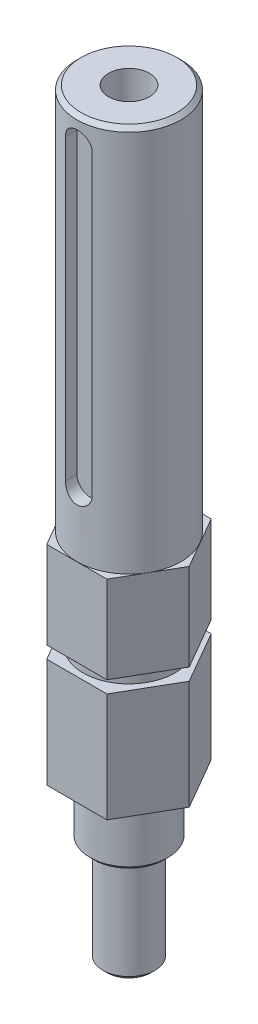
ISO-10303-21;
HEADER;
FILE_DESCRIPTION(('STEP AP214'),'2;1');
FILE_NAME('part.step','',(''),(''),'','','');
FILE_SCHEMA(('AUTOMOTIVE_DESIGN { 1 0 10303 214 1 1 1 1 }'));
ENDSEC;
DATA;
#1=APPLICATION_CONTEXT('core data for automotive mechanical design processes');
#2=APPLICATION_PROTOCOL_DEFINITION('international standard','automotive_design',2000,#1);
#3=PRODUCT_CONTEXT('',#1,'mechanical');
#4=PRODUCT('Part','Part','',(#3));
#5=PRODUCT_RELATED_PRODUCT_CATEGORY('part','',(#4));
#6=PRODUCT_DEFINITION_FORMATION('','',#4);
#7=PRODUCT_DEFINITION_CONTEXT('part definition',#1,'design');
#8=PRODUCT_DEFINITION('design','',#6,#7);
#9=PRODUCT_DEFINITION_SHAPE('','',#8);
#10=(LENGTH_UNIT() NAMED_UNIT(*) SI_UNIT(.MILLI.,.METRE.));
#11=(NAMED_UNIT(*) PLANE_ANGLE_UNIT() SI_UNIT($,.RADIAN.));
#12=(NAMED_UNIT(*) SI_UNIT($,.STERADIAN.) SOLID_ANGLE_UNIT());
#13=UNCERTAINTY_MEASURE_WITH_UNIT(LENGTH_MEASURE(1.E-05),#10,'distance_accuracy_value','');
#14=(GEOMETRIC_REPRESENTATION_CONTEXT(3) GLOBAL_UNCERTAINTY_ASSIGNED_CONTEXT((#13)) GLOBAL_UNIT_ASSIGNED_CONTEXT((#10,
#11,#12)) REPRESENTATION_CONTEXT('',''));
#15=CARTESIAN_POINT('',(0.,0.,0.));
#16=DIRECTION('',(0.,0.,1.));
#17=DIRECTION('',(1.,0.,0.));
#18=AXIS2_PLACEMENT_3D('',#15,#16,#17);
#19=CARTESIAN_POINT('',(-38.3071337161431,-45.212,-16.669011646302));
#20=DIRECTION('',(0.,1.,0.));
#21=DIRECTION('',(0.,0.,1.));
#22=AXIS2_PLACEMENT_3D('',#19,#20,#21);
#23=PLANE('',#22);
#24=CARTESIAN_POINT('',(-38.3071337161431,-45.2119999999923,-16.669011646302));
#25=DIRECTION('',(0.,1.,0.));
#26=DIRECTION('',(0.,0.,1.));
#27=AXIS2_PLACEMENT_3D('',#24,#25,#26);
#28=CIRCLE('',#27,2.65430000009029);
#29=CARTESIAN_POINT('',(-38.3071337161431,-45.2119999999923,-14.0147116462117));
#30=VERTEX_POINT('',#29);
#31=EDGE_CURVE('E19',#30,#30,#28,.T.);
#32=ORIENTED_EDGE('',*,*,#31,.F.);
#33=EDGE_LOOP('',(#32));
#34=FACE_BOUND('',#33,.T.);
#35=ADVANCED_FACE('F16',(#34),#23,.F.);
#36=CARTESIAN_POINT('',(-38.3071337161431,-44.704000000138,-16.669011646302));
#37=DIRECTION('',(0.,1.,0.));
#38=DIRECTION('',(0.,0.,1.));
#39=AXIS2_PLACEMENT_3D('',#36,#37,#38);
#40=CONICAL_SURFACE('',#39,3.16229999994458,0.785398163397448);
#41=CARTESIAN_POINT('',(-38.3071337161431,-44.704,-16.669011646302));
#42=DIRECTION('',(0.,-1.,0.));
#43=DIRECTION('',(0.,0.,-1.));
#44=AXIS2_PLACEMENT_3D('',#41,#42,#43);
#45=CIRCLE('',#44,3.1623);
#46=CARTESIAN_POINT('',(-38.3071337161431,-44.704,-19.831311646302));
#47=VERTEX_POINT('',#46);
#48=EDGE_CURVE('E158',#47,#47,#45,.F.);
#49=ORIENTED_EDGE('',*,*,#48,.F.);
#50=EDGE_LOOP('',(#49));
#51=FACE_BOUND('',#50,.T.);
#52=ORIENTED_EDGE('',*,*,#31,.T.);
#53=EDGE_LOOP('',(#52));
#54=FACE_BOUND('',#53,.T.);
#55=ADVANCED_FACE('F348',(#51,#54),#40,.T.);
#56=CARTESIAN_POINT('',(-38.3071337161431,-45.212,-16.669011646302));
#57=DIRECTION('',(0.,-1.,0.));
#58=DIRECTION('',(0.,0.,-1.));
#59=AXIS2_PLACEMENT_3D('',#56,#57,#58);
#60=CYLINDRICAL_SURFACE('',#59,3.1623);
#61=CARTESIAN_POINT('',(-38.3071337161431,-32.512,-16.669011646302));
#62=DIRECTION('',(0.,-1.,0.));
#63=DIRECTION('',(0.,0.,-1.));
#64=AXIS2_PLACEMENT_3D('',#61,#62,#63);
#65=CIRCLE('',#64,3.1623);
#66=CARTESIAN_POINT('',(-38.3071337161431,-32.512,-19.831311646302));
#67=VERTEX_POINT('',#66);
#68=EDGE_CURVE('E161',#67,#67,#65,.T.);
#69=ORIENTED_EDGE('',*,*,#68,.T.);
#70=EDGE_LOOP('',(#69));
#71=FACE_BOUND('',#70,.T.);
#72=ORIENTED_EDGE('',*,*,#48,.T.);
#73=EDGE_LOOP('',(#72));
#74=FACE_BOUND('',#73,.T.);
#75=ADVANCED_FACE('F333',(#71,#74),#60,.T.);
#76=CARTESIAN_POINT('',(-38.3071337161431,-32.512,-16.669011646302));
#77=DIRECTION('',(0.,1.,0.));
#78=DIRECTION('',(0.,0.,1.));
#79=AXIS2_PLACEMENT_3D('',#76,#77,#78);
#80=PLANE('',#79);
#81=CARTESIAN_POINT('',(-38.3071337161431,-32.511999999997,-16.669011646302));
#82=DIRECTION('',(0.,1.,0.));
#83=DIRECTION('',(0.,0.,1.));
#84=AXIS2_PLACEMENT_3D('',#81,#82,#83);
#85=CIRCLE('',#84,4.24179999994759);
#86=CARTESIAN_POINT('',(-38.3071337161431,-32.511999999997,-12.4272116463544));
#87=VERTEX_POINT('',#86);
#88=EDGE_CURVE('E155',#87,#87,#85,.T.);
#89=ORIENTED_EDGE('',*,*,#88,.F.);
#90=EDGE_LOOP('',(#89));
#91=FACE_BOUND('',#90,.T.);
#92=ORIENTED_EDGE('',*,*,#68,.F.);
#93=EDGE_LOOP('',(#92));
#94=FACE_BOUND('',#93,.T.);
#95=ADVANCED_FACE('F336',(#91,#94),#80,.F.);
#96=CARTESIAN_POINT('',(-38.3071337161431,-32.0039999999722,-16.669011646302));
#97=DIRECTION('',(0.,1.,0.));
#98=DIRECTION('',(0.,0.,1.));
#99=AXIS2_PLACEMENT_3D('',#96,#97,#98);
#100=CONICAL_SURFACE('',#99,4.74980000002926,0.785398163453397);
#101=CARTESIAN_POINT('',(-38.3071337161431,-32.004,-16.669011646302));
#102=DIRECTION('',(0.,-1.,0.));
#103=DIRECTION('',(0.,0.,-1.));
#104=AXIS2_PLACEMENT_3D('',#101,#102,#103);
#105=CIRCLE('',#104,4.7498);
#106=CARTESIAN_POINT('',(-38.3071337161431,-32.004,-21.418811646302));
#107=VERTEX_POINT('',#106);
#108=EDGE_CURVE('E152',#107,#107,#105,.F.);
#109=ORIENTED_EDGE('',*,*,#108,.F.);
#110=EDGE_LOOP('',(#109));
#111=FACE_BOUND('',#110,.T.);
#112=ORIENTED_EDGE('',*,*,#88,.T.);
#113=EDGE_LOOP('',(#112));
#114=FACE_BOUND('',#113,.T.);
#115=ADVANCED_FACE('F338',(#111,#114),#100,.T.);
#116=CARTESIAN_POINT('',(-38.3071337161431,-32.512,-16.669011646302));
#117=DIRECTION('',(0.,-1.,0.));
#118=DIRECTION('',(0.,0.,-1.));
#119=AXIS2_PLACEMENT_3D('',#116,#117,#118);
#120=CYLINDRICAL_SURFACE('',#119,4.7498);
#121=CARTESIAN_POINT('',(-38.3071337161431,-25.4,-16.669011646302));
#122=DIRECTION('',(0.,-1.,0.));
#123=DIRECTION('',(0.,0.,-1.));
#124=AXIS2_PLACEMENT_3D('',#121,#122,#123);
#125=CIRCLE('',#124,4.7498);
#126=CARTESIAN_POINT('',(-38.3071337161431,-25.4,-21.418811646302));
#127=VERTEX_POINT('',#126);
#128=EDGE_CURVE('E134',#127,#127,#125,.T.);
#129=ORIENTED_EDGE('',*,*,#128,.T.);
#130=EDGE_LOOP('',(#129));
#131=FACE_BOUND('',#130,.T.);
#132=ORIENTED_EDGE('',*,*,#108,.T.);
#133=EDGE_LOOP('',(#132));
#134=FACE_BOUND('',#133,.T.);
#135=ADVANCED_FACE('F345',(#131,#134),#120,.T.);
#136=CARTESIAN_POINT('',(-38.3071337161431,-25.4,-3.96901164630201));
#137=DIRECTION('',(0.,1.,0.));
#138=DIRECTION('',(0.,0.,1.));
#139=AXIS2_PLACEMENT_3D('',#136,#137,#138);
#140=PLANE('',#139);
#141=DIRECTION('',(-0.5,0.,0.866025403784438));
#142=VECTOR('',#141,1.);
#143=CARTESIAN_POINT('',(-41.9733079254973,-25.4,-23.019011646302));
#144=LINE('',#143,#142);
#145=CARTESIAN_POINT('',(-41.9733079254973,-25.4,-23.019011646302));
#146=VERTEX_POINT('',#145);
#147=CARTESIAN_POINT('',(-45.6394821348514,-25.4,-16.669011646302));
#148=VERTEX_POINT('',#147);
#149=EDGE_CURVE('E123',#146,#148,#144,.T.);
#150=ORIENTED_EDGE('',*,*,#149,.F.);
#151=DIRECTION('',(-1.,0.,0.));
#152=VECTOR('',#151,1.);
#153=CARTESIAN_POINT('',(-34.640959506789,-25.4,-23.019011646302));
#154=LINE('',#153,#152);
#155=CARTESIAN_POINT('',(-34.640959506789,-25.4,-23.019011646302));
#156=VERTEX_POINT('',#155);
#157=EDGE_CURVE('E128',#156,#146,#154,.T.);
#158=ORIENTED_EDGE('',*,*,#157,.F.);
#159=DIRECTION('',(-0.5,0.,-0.866025403784438));
#160=VECTOR('',#159,1.);
#161=CARTESIAN_POINT('',(-30.9747852974349,-25.4,-16.669011646302));
#162=LINE('',#161,#160);
#163=CARTESIAN_POINT('',(-30.9747852974349,-25.4,-16.669011646302));
#164=VERTEX_POINT('',#163);
#165=EDGE_CURVE('E143',#164,#156,#162,.T.);
#166=ORIENTED_EDGE('',*,*,#165,.F.);
#167=DIRECTION('',(0.500000000000001,0.,-0.866025403784438));
#168=VECTOR('',#167,1.);
#169=CARTESIAN_POINT('',(-34.640959506789,-25.4,-10.319011646302));
#170=LINE('',#169,#168);
#171=CARTESIAN_POINT('',(-34.640959506789,-25.4,-10.319011646302));
#172=VERTEX_POINT('',#171);
#173=EDGE_CURVE('E296',#172,#164,#170,.T.);
#174=ORIENTED_EDGE('',*,*,#173,.F.);
#175=DIRECTION('',(1.,0.,0.));
#176=VECTOR('',#175,1.);
#177=CARTESIAN_POINT('',(-41.9733079254973,-25.4,-10.319011646302));
#178=LINE('',#177,#176);
#179=CARTESIAN_POINT('',(-41.9733079254973,-25.4,-10.319011646302));
#180=VERTEX_POINT('',#179);
#181=EDGE_CURVE('E290',#180,#172,#178,.T.);
#182=ORIENTED_EDGE('',*,*,#181,.F.);
#183=DIRECTION('',(0.5,0.,0.866025403784438));
#184=VECTOR('',#183,1.);
#185=CARTESIAN_POINT('',(-45.6394821348514,-25.4,-16.669011646302));
#186=LINE('',#185,#184);
#187=EDGE_CURVE('E131',#148,#180,#186,.T.);
#188=ORIENTED_EDGE('',*,*,#187,.F.);
#189=EDGE_LOOP('',(#150,#158,#166,#174,#182,#188));
#190=FACE_BOUND('',#189,.T.);
#191=ORIENTED_EDGE('',*,*,#128,.F.);
#192=EDGE_LOOP('',(#191));
#193=FACE_BOUND('',#192,.T.);
#194=ADVANCED_FACE('F125',(#190,#193),#140,.F.);
#195=CARTESIAN_POINT('',(-41.9733079254973,-25.4,-23.019011646302));
#196=DIRECTION('',(-0.866025403784438,0.,-0.5));
#197=DIRECTION('',(-0.5,0.,0.866025403784438));
#198=AXIS2_PLACEMENT_3D('',#195,#196,#197);
#199=PLANE('',#198);
#200=ORIENTED_EDGE('',*,*,#149,.T.);
#201=DIRECTION('',(0.,1.,0.));
#202=VECTOR('',#201,1.);
#203=CARTESIAN_POINT('',(-45.6394821348514,-25.4,-16.669011646302));
#204=LINE('',#203,#202);
#205=CARTESIAN_POINT('',(-45.6394821348514,-12.1158,-16.669011646302));
#206=VERTEX_POINT('',#205);
#207=EDGE_CURVE('E285',#206,#148,#204,.F.);
#208=ORIENTED_EDGE('',*,*,#207,.F.);
#209=DIRECTION('',(0.499999999999997,0.,-0.86602540378444));
#210=VECTOR('',#209,1.);
#211=CARTESIAN_POINT('',(-45.6394821348514,-12.1158,-16.669011646302));
#212=LINE('',#211,#210);
#213=CARTESIAN_POINT('',(-41.9733079254973,-12.1158,-23.019011646302));
#214=VERTEX_POINT('',#213);
#215=EDGE_CURVE('E140',#206,#214,#212,.T.);
#216=ORIENTED_EDGE('',*,*,#215,.T.);
#217=DIRECTION('',(0.,1.,0.));
#218=VECTOR('',#217,1.);
#219=CARTESIAN_POINT('',(-41.9733079254973,-25.4,-23.019011646302));
#220=LINE('',#219,#218);
#221=EDGE_CURVE('E137',#146,#214,#220,.T.);
#222=ORIENTED_EDGE('',*,*,#221,.F.);
#223=EDGE_LOOP('',(#200,#208,#216,#222));
#224=FACE_BOUND('',#223,.T.);
#225=ADVANCED_FACE('F138',(#224),#199,.T.);
#226=CARTESIAN_POINT('',(-34.640959506789,-25.4,-23.019011646302));
#227=DIRECTION('',(0.,0.,-1.));
#228=DIRECTION('',(-1.,0.,0.));
#229=AXIS2_PLACEMENT_3D('',#226,#227,#228);
#230=PLANE('',#229);
#231=ORIENTED_EDGE('',*,*,#157,.T.);
#232=ORIENTED_EDGE('',*,*,#221,.T.);
#233=DIRECTION('',(1.,0.,0.));
#234=VECTOR('',#233,1.);
#235=CARTESIAN_POINT('',(-21.7881364409388,-12.1158,-23.019011646302));
#236=LINE('',#235,#234);
#237=CARTESIAN_POINT('',(-34.640959506789,-12.1158,-23.019011646302));
#238=VERTEX_POINT('',#237);
#239=EDGE_CURVE('E278',#214,#238,#236,.T.);
#240=ORIENTED_EDGE('',*,*,#239,.T.);
#241=DIRECTION('',(0.,1.,0.));
#242=VECTOR('',#241,1.);
#243=CARTESIAN_POINT('',(-34.640959506789,-25.4,-23.019011646302));
#244=LINE('',#243,#242);
#245=EDGE_CURVE('E147',#156,#238,#244,.T.);
#246=ORIENTED_EDGE('',*,*,#245,.F.);
#247=EDGE_LOOP('',(#231,#232,#240,#246));
#248=FACE_BOUND('',#247,.T.);
#249=ADVANCED_FACE('F145',(#248),#230,.T.);
#250=CARTESIAN_POINT('',(-30.9747852974349,-25.4,-16.669011646302));
#251=DIRECTION('',(0.866025403784438,0.,-0.5));
#252=DIRECTION('',(-0.5,0.,-0.866025403784438));
#253=AXIS2_PLACEMENT_3D('',#250,#251,#252);
#254=PLANE('',#253);
#255=ORIENTED_EDGE('',*,*,#165,.T.);
#256=ORIENTED_EDGE('',*,*,#245,.T.);
#257=DIRECTION('',(0.499999999999998,0.,0.86602540378444));
#258=VECTOR('',#257,1.);
#259=CARTESIAN_POINT('',(-34.640959506789,-12.1158,-23.019011646302));
#260=LINE('',#259,#258);
#261=CARTESIAN_POINT('',(-30.9747852974349,-12.1158,-16.669011646302));
#262=VERTEX_POINT('',#261);
#263=EDGE_CURVE('E276',#238,#262,#260,.T.);
#264=ORIENTED_EDGE('',*,*,#263,.T.);
#265=DIRECTION('',(0.,1.,0.));
#266=VECTOR('',#265,1.);
#267=CARTESIAN_POINT('',(-30.9747852974349,-25.4,-16.669011646302));
#268=LINE('',#267,#266);
#269=EDGE_CURVE('E293',#164,#262,#268,.T.);
#270=ORIENTED_EDGE('',*,*,#269,.F.);
#271=EDGE_LOOP('',(#255,#256,#264,#270));
#272=FACE_BOUND('',#271,.T.);
#273=ADVANCED_FACE('F301',(#272),#254,.T.);
#274=CARTESIAN_POINT('',(-34.640959506789,-25.4,-10.319011646302));
#275=DIRECTION('',(0.866025403784438,0.,0.500000000000001));
#276=DIRECTION('',(0.500000000000001,0.,-0.866025403784438));
#277=AXIS2_PLACEMENT_3D('',#274,#275,#276);
#278=PLANE('',#277);
#279=ORIENTED_EDGE('',*,*,#173,.T.);
#280=ORIENTED_EDGE('',*,*,#269,.T.);
#281=DIRECTION('',(-0.499999999999998,0.,0.86602540378444));
#282=VECTOR('',#281,1.);
#283=CARTESIAN_POINT('',(-30.9747852974349,-12.1158,-16.669011646302));
#284=LINE('',#283,#282);
#285=CARTESIAN_POINT('',(-34.640959506789,-12.1158,-10.319011646302));
#286=VERTEX_POINT('',#285);
#287=EDGE_CURVE('E274',#262,#286,#284,.T.);
#288=ORIENTED_EDGE('',*,*,#287,.T.);
#289=DIRECTION('',(0.,1.,0.));
#290=VECTOR('',#289,1.);
#291=CARTESIAN_POINT('',(-34.640959506789,-25.4,-10.319011646302));
#292=LINE('',#291,#290);
#293=EDGE_CURVE('E287',#172,#286,#292,.T.);
#294=ORIENTED_EDGE('',*,*,#293,.F.);
#295=EDGE_LOOP('',(#279,#280,#288,#294));
#296=FACE_BOUND('',#295,.T.);
#297=ADVANCED_FACE('F306',(#296),#278,.T.);
#298=CARTESIAN_POINT('',(-41.9733079254973,-25.4,-10.319011646302));
#299=DIRECTION('',(0.,0.,1.));
#300=DIRECTION('',(1.,0.,0.));
#301=AXIS2_PLACEMENT_3D('',#298,#299,#300);
#302=PLANE('',#301);
#303=ORIENTED_EDGE('',*,*,#181,.T.);
#304=ORIENTED_EDGE('',*,*,#293,.T.);
#305=DIRECTION('',(1.,0.,0.));
#306=VECTOR('',#305,1.);
#307=CARTESIAN_POINT('',(-21.7881364409388,-12.1158,-10.319011646302));
#308=LINE('',#307,#306);
#309=CARTESIAN_POINT('',(-41.9733079254973,-12.1158,-10.319011646302));
#310=VERTEX_POINT('',#309);
#311=EDGE_CURVE('E272',#286,#310,#308,.F.);
#312=ORIENTED_EDGE('',*,*,#311,.T.);
#313=DIRECTION('',(0.,1.,0.));
#314=VECTOR('',#313,1.);
#315=CARTESIAN_POINT('',(-41.9733079254973,-25.4,-10.319011646302));
#316=LINE('',#315,#314);
#317=EDGE_CURVE('E281',#180,#310,#316,.T.);
#318=ORIENTED_EDGE('',*,*,#317,.F.);
#319=EDGE_LOOP('',(#303,#304,#312,#318));
#320=FACE_BOUND('',#319,.T.);
#321=ADVANCED_FACE('F310',(#320),#302,.T.);
#322=CARTESIAN_POINT('',(-45.6394821348514,-25.4,-16.669011646302));
#323=DIRECTION('',(-0.866025403784438,0.,0.5));
#324=DIRECTION('',(0.5,0.,0.866025403784438));
#325=AXIS2_PLACEMENT_3D('',#322,#323,#324);
#326=PLANE('',#325);
#327=ORIENTED_EDGE('',*,*,#187,.T.);
#328=ORIENTED_EDGE('',*,*,#317,.T.);
#329=DIRECTION('',(-0.499999999999997,0.,-0.86602540378444));
#330=VECTOR('',#329,1.);
#331=CARTESIAN_POINT('',(-41.9733079254973,-12.1158,-10.319011646302));
#332=LINE('',#331,#330);
#333=EDGE_CURVE('E269',#310,#206,#332,.T.);
#334=ORIENTED_EDGE('',*,*,#333,.T.);
#335=ORIENTED_EDGE('',*,*,#207,.T.);
#336=EDGE_LOOP('',(#327,#328,#334,#335));
#337=FACE_BOUND('',#336,.T.);
#338=ADVANCED_FACE('F313',(#337),#326,.T.);
#339=CARTESIAN_POINT('',(-21.7881364409388,-12.1158,-16.669011646302));
#340=DIRECTION('',(0.,-1.,0.));
#341=DIRECTION('',(0.,0.,-1.));
#342=AXIS2_PLACEMENT_3D('',#339,#340,#341);
#343=PLANE('',#342);
#344=ORIENTED_EDGE('',*,*,#311,.F.);
#345=ORIENTED_EDGE('',*,*,#287,.F.);
#346=ORIENTED_EDGE('',*,*,#263,.F.);
#347=ORIENTED_EDGE('',*,*,#239,.F.);
#348=ORIENTED_EDGE('',*,*,#215,.F.);
#349=ORIENTED_EDGE('',*,*,#333,.F.);
#350=EDGE_LOOP('',(#344,#345,#346,#347,#348,#349));
#351=FACE_BOUND('',#350,.T.);
#352=CARTESIAN_POINT('',(-38.3071337161431,-12.1158,-16.669011646302));
#353=DIRECTION('',(0.,-1.,0.));
#354=DIRECTION('',(0.,0.,-1.));
#355=AXIS2_PLACEMENT_3D('',#352,#353,#354);
#356=CIRCLE('',#355,5.58800000000003);
#357=CARTESIAN_POINT('',(-38.3071337161431,-12.1158,-22.257011646302));
#358=VERTEX_POINT('',#357);
#359=EDGE_CURVE('E266',#358,#358,#356,.F.);
#360=ORIENTED_EDGE('',*,*,#359,.F.);
#361=EDGE_LOOP('',(#360));
#362=FACE_BOUND('',#361,.T.);
#363=ADVANCED_FACE('F315',(#351,#362),#343,.F.);
#364=CARTESIAN_POINT('',(-38.3071337161431,31.2419999999634,-16.669011646302));
#365=DIRECTION('',(0.,1.,0.));
#366=DIRECTION('',(-1.,0.,0.));
#367=AXIS2_PLACEMENT_3D('',#364,#365,#366);
#368=CONICAL_SURFACE('',#367,2.48792999984279,1.02974425854432);
#369=CARTESIAN_POINT('',(-38.3071337161431,29.7471008400976,-16.6690116461723));
#370=VERTEX_POINT('',#369);
#371=VERTEX_LOOP('',#370);
#372=FACE_BOUND('',#371,.T.);
#373=CARTESIAN_POINT('',(-38.3071337161431,31.242,-16.669011646302));
#374=DIRECTION('',(0.,1.,0.));
#375=DIRECTION('',(0.,0.,1.));
#376=AXIS2_PLACEMENT_3D('',#373,#374,#375);
#377=CIRCLE('',#376,2.48793);
#378=CARTESIAN_POINT('',(-38.3071337161431,31.242,-14.181081646302));
#379=VERTEX_POINT('',#378);
#380=EDGE_CURVE('E262',#379,#379,#377,.T.);
#381=ORIENTED_EDGE('',*,*,#380,.T.);
#382=EDGE_LOOP('',(#381));
#383=FACE_BOUND('',#382,.T.);
#384=ADVANCED_FACE('F318',(#372,#383),#368,.F.);
#385=CARTESIAN_POINT('',(-38.3071337161431,-25.4,-16.669011646302));
#386=DIRECTION('',(0.,-1.,0.));
#387=DIRECTION('',(0.,0.,-1.));
#388=AXIS2_PLACEMENT_3D('',#385,#386,#387);
#389=CYLINDRICAL_SURFACE('',#388,5.58800000000003);
#390=ORIENTED_EDGE('',*,*,#359,.T.);
#391=EDGE_LOOP('',(#390));
#392=FACE_BOUND('',#391,.T.);
#393=CARTESIAN_POINT('',(-38.3071337161431,-10.6172,-16.669011646302));
#394=DIRECTION('',(0.,-1.,0.));
#395=DIRECTION('',(0.,0.,-1.));
#396=AXIS2_PLACEMENT_3D('',#393,#394,#395);
#397=CIRCLE('',#396,5.58800000000003);
#398=CARTESIAN_POINT('',(-38.3071337161431,-10.6172,-22.257011646302));
#399=VERTEX_POINT('',#398);
#400=EDGE_CURVE('E265',#399,#399,#397,.T.);
#401=ORIENTED_EDGE('',*,*,#400,.T.);
#402=EDGE_LOOP('',(#401));
#403=FACE_BOUND('',#402,.T.);
#404=ADVANCED_FACE('F468',(#392,#403),#389,.T.);
#405=CARTESIAN_POINT('',(-38.3071337161431,47.117,-16.669011646302));
#406=DIRECTION('',(0.,1.,0.));
#407=DIRECTION('',(0.,0.,1.));
#408=AXIS2_PLACEMENT_3D('',#405,#406,#407);
#409=CYLINDRICAL_SURFACE('',#408,2.48793);
#410=CARTESIAN_POINT('',(-38.3071337161431,47.117,-16.669011646302));
#411=DIRECTION('',(0.,1.,0.));
#412=DIRECTION('',(0.,0.,1.));
#413=AXIS2_PLACEMENT_3D('',#410,#411,#412);
#414=CIRCLE('',#413,2.48793);
#415=CARTESIAN_POINT('',(-38.3071337161431,47.117,-14.181081646302));
#416=VERTEX_POINT('',#415);
#417=EDGE_CURVE('E259',#416,#416,#414,.T.);
#418=ORIENTED_EDGE('',*,*,#417,.T.);
#419=EDGE_LOOP('',(#418));
#420=FACE_BOUND('',#419,.T.);
#421=ORIENTED_EDGE('',*,*,#380,.F.);
#422=EDGE_LOOP('',(#421));
#423=FACE_BOUND('',#422,.T.);
#424=ADVANCED_FACE('F478',(#420,#423),#409,.F.);
#425=CARTESIAN_POINT('',(-32.7191337161431,-10.6172,-16.669011646302));
#426=DIRECTION('',(0.,1.,0.));
#427=DIRECTION('',(0.,0.,1.));
#428=AXIS2_PLACEMENT_3D('',#425,#426,#427);
#429=PLANE('',#428);
#430=ORIENTED_EDGE('',*,*,#400,.F.);
#431=EDGE_LOOP('',(#430));
#432=FACE_BOUND('',#431,.T.);
#433=DIRECTION('',(0.500000000000001,0.,-0.866025403784438));
#434=VECTOR('',#433,1.);
#435=CARTESIAN_POINT('',(-34.640959506789,-10.6172,-10.319011646302));
#436=LINE('',#435,#434);
#437=CARTESIAN_POINT('',(-34.640959506789,-10.6172,-10.319011646302));
#438=VERTEX_POINT('',#437);
#439=CARTESIAN_POINT('',(-30.9747852974349,-10.6172,-16.669011646302));
#440=VERTEX_POINT('',#439);
#441=EDGE_CURVE('E250',#438,#440,#436,.T.);
#442=ORIENTED_EDGE('',*,*,#441,.F.);
#443=DIRECTION('',(1.,0.,0.));
#444=VECTOR('',#443,1.);
#445=CARTESIAN_POINT('',(-41.9733079254973,-10.6172,-10.319011646302));
#446=LINE('',#445,#444);
#447=CARTESIAN_POINT('',(-41.9733079254973,-10.6172,-10.319011646302));
#448=VERTEX_POINT('',#447);
#449=EDGE_CURVE('E256',#448,#438,#446,.T.);
#450=ORIENTED_EDGE('',*,*,#449,.F.);
#451=DIRECTION('',(0.5,0.,0.866025403784438));
#452=VECTOR('',#451,1.);
#453=CARTESIAN_POINT('',(-45.6394821348514,-10.6172,-16.669011646302));
#454=LINE('',#453,#452);
#455=CARTESIAN_POINT('',(-45.6394821348514,-10.6172,-16.669011646302));
#456=VERTEX_POINT('',#455);
#457=EDGE_CURVE('E68',#456,#448,#454,.T.);
#458=ORIENTED_EDGE('',*,*,#457,.F.);
#459=DIRECTION('',(-0.5,0.,0.866025403784438));
#460=VECTOR('',#459,1.);
#461=CARTESIAN_POINT('',(-41.9733079254973,-10.6172,-23.019011646302));
#462=LINE('',#461,#460);
#463=CARTESIAN_POINT('',(-41.9733079254973,-10.6172,-23.019011646302));
#464=VERTEX_POINT('',#463);
#465=EDGE_CURVE('E232',#464,#456,#462,.T.);
#466=ORIENTED_EDGE('',*,*,#465,.F.);
#467=DIRECTION('',(-1.,0.,0.));
#468=VECTOR('',#467,1.);
#469=CARTESIAN_POINT('',(-34.640959506789,-10.6172,-23.019011646302));
#470=LINE('',#469,#468);
#471=CARTESIAN_POINT('',(-34.640959506789,-10.6172,-23.019011646302));
#472=VERTEX_POINT('',#471);
#473=EDGE_CURVE('E238',#472,#464,#470,.T.);
#474=ORIENTED_EDGE('',*,*,#473,.F.);
#475=DIRECTION('',(-0.5,0.,-0.866025403784438));
#476=VECTOR('',#475,1.);
#477=CARTESIAN_POINT('',(-30.9747852974349,-10.6172,-16.669011646302));
#478=LINE('',#477,#476);
#479=EDGE_CURVE('E244',#440,#472,#478,.T.);
#480=ORIENTED_EDGE('',*,*,#479,.F.);
#481=EDGE_LOOP('',(#442,#450,#458,#466,#474,#480));
#482=FACE_BOUND('',#481,.T.);
#483=ADVANCED_FACE('F487',(#432,#482),#429,.F.);
#484=CARTESIAN_POINT('',(-38.2944337161431,7.62,-11.944611646302));
#485=DIRECTION('',(0.,0.,1.));
#486=DIRECTION('',(1.,0.,0.));
#487=AXIS2_PLACEMENT_3D('',#484,#485,#486);
#488=PLANE('',#487);
#489=CARTESIAN_POINT('',(-38.2944337161431,43.942,-11.944611646302));
#490=DIRECTION('',(0.,0.,-1.));
#491=DIRECTION('',(-1.,0.,0.));
#492=AXIS2_PLACEMENT_3D('',#489,#490,#491);
#493=CIRCLE('',#492,1.6256);
#494=CARTESIAN_POINT('',(-36.6688337161431,43.942,-11.944611646302));
#495=VERTEX_POINT('',#494);
#496=CARTESIAN_POINT('',(-39.9200337161431,43.942,-11.944611646302));
#497=VERTEX_POINT('',#496);
#498=EDGE_CURVE('E222',#495,#497,#493,.F.);
#499=ORIENTED_EDGE('',*,*,#498,.T.);
#500=DIRECTION('',(0.,1.,0.));
#501=VECTOR('',#500,1.);
#502=CARTESIAN_POINT('',(-39.9200337161431,43.942,-11.944611646302));
#503=LINE('',#502,#501);
#504=CARTESIAN_POINT('',(-39.9200337161431,7.62,-11.944611646302));
#505=VERTEX_POINT('',#504);
#506=EDGE_CURVE('E59',#497,#505,#503,.F.);
#507=ORIENTED_EDGE('',*,*,#506,.T.);
#508=CARTESIAN_POINT('',(-38.2944337161431,7.62,-11.944611646302));
#509=DIRECTION('',(0.,0.,-1.));
#510=DIRECTION('',(-1.,0.,0.));
#511=AXIS2_PLACEMENT_3D('',#508,#509,#510);
#512=CIRCLE('',#511,1.6256);
#513=CARTESIAN_POINT('',(-36.6688337161431,7.62,-11.944611646302));
#514=VERTEX_POINT('',#513);
#515=EDGE_CURVE('E228',#505,#514,#512,.F.);
#516=ORIENTED_EDGE('',*,*,#515,.T.);
#517=DIRECTION('',(0.,1.,0.));
#518=VECTOR('',#517,1.);
#519=CARTESIAN_POINT('',(-36.6688337161431,7.62,-11.944611646302));
#520=LINE('',#519,#518);
#521=EDGE_CURVE('E207',#514,#495,#520,.T.);
#522=ORIENTED_EDGE('',*,*,#521,.T.);
#523=EDGE_LOOP('',(#499,#507,#516,#522));
#524=FACE_BOUND('',#523,.T.);
#525=ADVANCED_FACE('F497',(#524),#488,.T.);
#526=CARTESIAN_POINT('',(-38.3071337161431,47.117,-16.669011646302));
#527=DIRECTION('',(0.,-1.,0.));
#528=DIRECTION('',(0.,0.,-1.));
#529=AXIS2_PLACEMENT_3D('',#526,#527,#528);
#530=PLANE('',#529);
#531=CARTESIAN_POINT('',(-38.3071337161431,47.1169999999574,-16.669011646302));
#532=DIRECTION('',(0.,-1.,0.));
#533=DIRECTION('',(0.,0.,-1.));
#534=AXIS2_PLACEMENT_3D('',#531,#532,#533);
#535=CIRCLE('',#534,5.82930000000023);
#536=CARTESIAN_POINT('',(-38.3071337161431,47.1169999999574,-22.4983116463022));
#537=VERTEX_POINT('',#536);
#538=EDGE_CURVE('E209',#537,#537,#535,.T.);
#539=ORIENTED_EDGE('',*,*,#538,.F.);
#540=EDGE_LOOP('',(#539));
#541=FACE_BOUND('',#540,.T.);
#542=ORIENTED_EDGE('',*,*,#417,.F.);
#543=EDGE_LOOP('',(#542));
#544=FACE_BOUND('',#543,.T.);
#545=ADVANCED_FACE('F507',(#541,#544),#530,.F.);
#546=CARTESIAN_POINT('',(-45.6394821348514,-25.4,-16.669011646302));
#547=DIRECTION('',(-0.866025403784438,0.,0.5));
#548=DIRECTION('',(0.5,0.,0.866025403784438));
#549=AXIS2_PLACEMENT_3D('',#546,#547,#548);
#550=PLANE('',#549);
#551=DIRECTION('',(0.499999999999997,0.,0.86602540378444));
#552=VECTOR('',#551,1.);
#553=CARTESIAN_POINT('',(-45.6394821348514,0.,-16.669011646302));
#554=LINE('',#553,#552);
#555=CARTESIAN_POINT('',(-45.6394821348514,0.,-16.669011646302));
#556=VERTEX_POINT('',#555);
#557=CARTESIAN_POINT('',(-41.9733079254973,0.,-10.319011646302));
#558=VERTEX_POINT('',#557);
#559=EDGE_CURVE('E212',#556,#558,#554,.T.);
#560=ORIENTED_EDGE('',*,*,#559,.F.);
#561=DIRECTION('',(0.,1.,0.));
#562=VECTOR('',#561,1.);
#563=CARTESIAN_POINT('',(-45.6394821348514,-25.4,-16.669011646302));
#564=LINE('',#563,#562);
#565=EDGE_CURVE('E229',#456,#556,#564,.T.);
#566=ORIENTED_EDGE('',*,*,#565,.F.);
#567=ORIENTED_EDGE('',*,*,#457,.T.);
#568=DIRECTION('',(0.,1.,0.));
#569=VECTOR('',#568,1.);
#570=CARTESIAN_POINT('',(-41.9733079254973,-25.4,-10.319011646302));
#571=LINE('',#570,#569);
#572=EDGE_CURVE('E253',#558,#448,#571,.F.);
#573=ORIENTED_EDGE('',*,*,#572,.F.);
#574=EDGE_LOOP('',(#560,#566,#567,#573));
#575=FACE_BOUND('',#574,.T.);
#576=ADVANCED_FACE('F516',(#575),#550,.T.);
#577=CARTESIAN_POINT('',(-41.9733079254973,-25.4,-10.319011646302));
#578=DIRECTION('',(0.,0.,1.));
#579=DIRECTION('',(1.,0.,0.));
#580=AXIS2_PLACEMENT_3D('',#577,#578,#579);
#581=PLANE('',#580);
#582=DIRECTION('',(1.,0.,0.));
#583=VECTOR('',#582,1.);
#584=CARTESIAN_POINT('',(-38.3071337161431,0.,-10.319011646302));
#585=LINE('',#584,#583);
#586=CARTESIAN_POINT('',(-34.640959506789,0.,-10.319011646302));
#587=VERTEX_POINT('',#586);
#588=EDGE_CURVE('E655',#558,#587,#585,.T.);
#589=ORIENTED_EDGE('',*,*,#588,.F.);
#590=ORIENTED_EDGE('',*,*,#572,.T.);
#591=ORIENTED_EDGE('',*,*,#449,.T.);
#592=DIRECTION('',(0.,1.,0.));
#593=VECTOR('',#592,1.);
#594=CARTESIAN_POINT('',(-34.640959506789,-25.4,-10.319011646302));
#595=LINE('',#594,#593);
#596=EDGE_CURVE('E247',#587,#438,#595,.F.);
#597=ORIENTED_EDGE('',*,*,#596,.F.);
#598=EDGE_LOOP('',(#589,#590,#591,#597));
#599=FACE_BOUND('',#598,.T.);
#600=ADVANCED_FACE('F526',(#599),#581,.T.);
#601=CARTESIAN_POINT('',(-34.640959506789,-25.4,-10.319011646302));
#602=DIRECTION('',(0.866025403784438,0.,0.500000000000001));
#603=DIRECTION('',(0.500000000000001,0.,-0.866025403784438));
#604=AXIS2_PLACEMENT_3D('',#601,#602,#603);
#605=PLANE('',#604);
#606=DIRECTION('',(0.499999999999998,0.,-0.86602540378444));
#607=VECTOR('',#606,1.);
#608=CARTESIAN_POINT('',(-34.640959506789,0.,-10.319011646302));
#609=LINE('',#608,#607);
#610=CARTESIAN_POINT('',(-30.9747852974349,0.,-16.669011646302));
#611=VERTEX_POINT('',#610);
#612=EDGE_CURVE('E647',#587,#611,#609,.T.);
#613=ORIENTED_EDGE('',*,*,#612,.F.);
#614=ORIENTED_EDGE('',*,*,#596,.T.);
#615=ORIENTED_EDGE('',*,*,#441,.T.);
#616=DIRECTION('',(0.,1.,0.));
#617=VECTOR('',#616,1.);
#618=CARTESIAN_POINT('',(-30.9747852974349,-25.4,-16.669011646302));
#619=LINE('',#618,#617);
#620=EDGE_CURVE('E241',#611,#440,#619,.F.);
#621=ORIENTED_EDGE('',*,*,#620,.F.);
#622=EDGE_LOOP('',(#613,#614,#615,#621));
#623=FACE_BOUND('',#622,.T.);
#624=ADVANCED_FACE('F536',(#623),#605,.T.);
#625=CARTESIAN_POINT('',(-30.9747852974349,-25.4,-16.669011646302));
#626=DIRECTION('',(0.866025403784438,0.,-0.5));
#627=DIRECTION('',(-0.5,0.,-0.866025403784438));
#628=AXIS2_PLACEMENT_3D('',#625,#626,#627);
#629=PLANE('',#628);
#630=DIRECTION('',(-0.499999999999998,0.,-0.86602540378444));
#631=VECTOR('',#630,1.);
#632=CARTESIAN_POINT('',(-30.9747852974349,0.,-16.669011646302));
#633=LINE('',#632,#631);
#634=CARTESIAN_POINT('',(-34.640959506789,0.,-23.019011646302));
#635=VERTEX_POINT('',#634);
#636=EDGE_CURVE('E654',#611,#635,#633,.T.);
#637=ORIENTED_EDGE('',*,*,#636,.F.);
#638=ORIENTED_EDGE('',*,*,#620,.T.);
#639=ORIENTED_EDGE('',*,*,#479,.T.);
#640=DIRECTION('',(0.,1.,0.));
#641=VECTOR('',#640,1.);
#642=CARTESIAN_POINT('',(-34.640959506789,-25.4,-23.019011646302));
#643=LINE('',#642,#641);
#644=EDGE_CURVE('E235',#635,#472,#643,.F.);
#645=ORIENTED_EDGE('',*,*,#644,.F.);
#646=EDGE_LOOP('',(#637,#638,#639,#645));
#647=FACE_BOUND('',#646,.T.);
#648=ADVANCED_FACE('F546',(#647),#629,.T.);
#649=CARTESIAN_POINT('',(-34.640959506789,-25.4,-23.019011646302));
#650=DIRECTION('',(0.,0.,-1.));
#651=DIRECTION('',(-1.,0.,0.));
#652=AXIS2_PLACEMENT_3D('',#649,#650,#651);
#653=PLANE('',#652);
#654=DIRECTION('',(1.,0.,0.));
#655=VECTOR('',#654,1.);
#656=CARTESIAN_POINT('',(-38.3071337161431,0.,-23.019011646302));
#657=LINE('',#656,#655);
#658=CARTESIAN_POINT('',(-41.9733079254973,0.,-23.019011646302));
#659=VERTEX_POINT('',#658);
#660=EDGE_CURVE('E664',#635,#659,#657,.F.);
#661=ORIENTED_EDGE('',*,*,#660,.F.);
#662=ORIENTED_EDGE('',*,*,#644,.T.);
#663=ORIENTED_EDGE('',*,*,#473,.T.);
#664=DIRECTION('',(0.,1.,0.));
#665=VECTOR('',#664,1.);
#666=CARTESIAN_POINT('',(-41.9733079254973,-25.4,-23.019011646302));
#667=LINE('',#666,#665);
#668=EDGE_CURVE('E225',#659,#464,#667,.F.);
#669=ORIENTED_EDGE('',*,*,#668,.F.);
#670=EDGE_LOOP('',(#661,#662,#663,#669));
#671=FACE_BOUND('',#670,.T.);
#672=ADVANCED_FACE('F556',(#671),#653,.T.);
#673=CARTESIAN_POINT('',(-41.9733079254973,-25.4,-23.019011646302));
#674=DIRECTION('',(-0.866025403784438,0.,-0.5));
#675=DIRECTION('',(-0.5,0.,0.866025403784438));
#676=AXIS2_PLACEMENT_3D('',#673,#674,#675);
#677=PLANE('',#676);
#678=DIRECTION('',(-0.499999999999997,0.,0.86602540378444));
#679=VECTOR('',#678,1.);
#680=CARTESIAN_POINT('',(-41.9733079254973,0.,-23.019011646302));
#681=LINE('',#680,#679);
#682=EDGE_CURVE('E666',#659,#556,#681,.T.);
#683=ORIENTED_EDGE('',*,*,#682,.F.);
#684=ORIENTED_EDGE('',*,*,#668,.T.);
#685=ORIENTED_EDGE('',*,*,#465,.T.);
#686=ORIENTED_EDGE('',*,*,#565,.T.);
#687=EDGE_LOOP('',(#683,#684,#685,#686));
#688=FACE_BOUND('',#687,.T.);
#689=ADVANCED_FACE('F566',(#688),#677,.T.);
#690=CARTESIAN_POINT('',(-38.2944337161431,7.62,-11.944611646302));
#691=DIRECTION('',(0.,0.,-1.));
#692=DIRECTION('',(-1.,0.,0.));
#693=AXIS2_PLACEMENT_3D('',#690,#691,#692);
#694=CYLINDRICAL_SURFACE('',#693,1.6256);
#695=DIRECTION('',(0.,0.,-1.));
#696=VECTOR('',#695,1.);
#697=CARTESIAN_POINT('',(-36.6688337161431,7.62,-11.944611646302));
#698=LINE('',#697,#696);
#699=CARTESIAN_POINT('',(-36.6688337161431,7.62,-10.5471373908146));
#700=VERTEX_POINT('',#699);
#701=EDGE_CURVE('E213',#700,#514,#698,.T.);
#702=ORIENTED_EDGE('',*,*,#701,.T.);
#703=ORIENTED_EDGE('',*,*,#515,.F.);
#704=DIRECTION('',(0.,0.,1.));
#705=VECTOR('',#704,1.);
#706=CARTESIAN_POINT('',(-39.9200337161431,7.62,-11.944611646302));
#707=LINE('',#706,#705);
#708=CARTESIAN_POINT('',(-39.9200337161431,7.62,-10.5403963965086));
#709=VERTEX_POINT('',#708);
#710=EDGE_CURVE('E223',#505,#709,#707,.T.);
#711=ORIENTED_EDGE('',*,*,#710,.T.);
#712=CARTESIAN_POINT('',(-36.6688337161431,7.62,-10.5471373908145));
#713=CARTESIAN_POINT('',(-36.6688331091211,7.57508676956372,-10.5471405182756));
#714=CARTESIAN_POINT('',(-36.6706962457444,7.53019584710579,-10.5466386386075));
#715=CARTESIAN_POINT('',(-36.678123083811,7.44075075384002,-10.544657178719));
#716=CARTESIAN_POINT('',(-36.6836861318509,7.39619652497702,-10.5431777711299));
#717=CARTESIAN_POINT('',(-36.7058421889299,7.26371365718299,-10.5373329317424));
#718=CARTESIAN_POINT('',(-36.7279024841407,7.1766970522348,-10.5315605059615));
#719=CARTESIAN_POINT('',(-36.7858812894694,7.00776425655234,-10.5169352836991));
#720=CARTESIAN_POINT('',(-36.8217979695406,6.92584739394119,-10.5080828940112));
#721=CARTESIAN_POINT('',(-36.9064235148925,6.76915869016789,-10.4882944814857));
#722=CARTESIAN_POINT('',(-36.9551361907329,6.69438898644195,-10.4773578382385));
#723=CARTESIAN_POINT('',(-37.0651790130352,6.55241146347382,-10.4543405349337));
#724=CARTESIAN_POINT('',(-37.1267531150963,6.48539589431971,-10.4422406430928));
#725=CARTESIAN_POINT('',(-37.2602504893411,6.36251357145926,-10.4184118928208));
#726=CARTESIAN_POINT('',(-37.332175442116,6.30664863172078,-10.4066830950194));
#727=CARTESIAN_POINT('',(-37.4856823536156,6.20684661901967,-10.3846912962059));
#728=CARTESIAN_POINT('',(-37.5673945479932,6.16310387834964,-10.3744533014004));
#729=CARTESIAN_POINT('',(-37.737315272444,6.09005152083161,-10.3568041875293));
#730=CARTESIAN_POINT('',(-37.8255224799875,6.06073897496487,-10.349392494854));
#731=CARTESIAN_POINT('',(-38.0039517924375,6.0179911330542,-10.3383506178957));
#732=CARTESIAN_POINT('',(-38.0940916347339,6.00423266043925,-10.3346436552414));
#733=CARTESIAN_POINT('',(-38.2754741033013,5.99197199958884,-10.33114201955));
#734=CARTESIAN_POINT('',(-38.3667165781547,5.99346773984195,-10.331346815302));
#735=CARTESIAN_POINT('',(-38.5454211572052,6.01144303891249,-10.3355769701775));
#736=CARTESIAN_POINT('',(-38.6329215953238,6.0275663413539,-10.3395115906581));
#737=CARTESIAN_POINT('',(-38.8039342379249,6.07376879728094,-10.3506330859961));
#738=CARTESIAN_POINT('',(-38.8874462699313,6.10384855370274,-10.3578201013608));
#739=CARTESIAN_POINT('',(-39.0489852800161,6.17737246854931,-10.3747532647595));
#740=CARTESIAN_POINT('',(-39.1269564548947,6.22093387014941,-10.3845217491481));
#741=CARTESIAN_POINT('',(-39.2746033865798,6.3200945348651,-10.4055506745099));
#742=CARTESIAN_POINT('',(-39.3442778265794,6.37569570492252,-10.4168113517171));
#743=CARTESIAN_POINT('',(-39.4754264045037,6.49920919031456,-10.4399645081475));
#744=CARTESIAN_POINT('',(-39.5366140469918,6.56742434188233,-10.4518658492884));
#745=CARTESIAN_POINT('',(-39.646763902012,6.71328583319706,-10.4746645306899));
#746=CARTESIAN_POINT('',(-39.6957227485741,6.79093476086333,-10.4855615940037));
#747=CARTESIAN_POINT('',(-39.780241642922,6.95408264682457,-10.5051471793903));
#748=CARTESIAN_POINT('',(-39.8157175237757,7.03962690287324,-10.5138217214079));
#749=CARTESIAN_POINT('',(-39.8716495997895,7.21568981055704,-10.5277978935588));
#750=CARTESIAN_POINT('',(-39.8921281763138,7.3062008320946,-10.5331045482044));
#751=CARTESIAN_POINT('',(-39.9098554782561,7.43458621495674,-10.5377252188414));
#752=CARTESIAN_POINT('',(-39.9136728670132,7.47158937744428,-10.5387252733945));
#753=CARTESIAN_POINT('',(-39.9187591835783,7.54572245347115,-10.5400606165068));
#754=CARTESIAN_POINT('',(-39.9200322081481,7.5828520666729,-10.5403969736951));
#755=CARTESIAN_POINT('',(-39.9200337161431,7.62,-10.5403963965086));
#756=B_SPLINE_CURVE_WITH_KNOTS('',3,(#712,#713,#714,#715,#716,#717,#718,#719,#720,#721,#722,
#723,#724,#725,#726,#727,#728,#729,#730,#731,#732,#733,#734,#735,#736,#737,#738,#739,#740,#741,
#742,#743,#744,#745,#746,#747,#748,#749,#750,#751,#752,#753,#754,#755),.UNSPECIFIED.,.F.,.F.,(4,
2,2,2,2,2,2,2,2,2,2,2,2,2,2,2,2,2,2,2,2,4),(0.,0.13465440535034,0.269285037084385,
0.537753454328434,0.806186426423097,1.07469942681537,1.34886316604649,1.62307146954232,
1.90145018784777,2.17977237794727,2.45219883298772,2.72458829319893,2.99051670004281,
3.25645659639434,3.52477750993718,3.79314095312924,4.06906868353483,4.34507227941813,
4.62277157392892,4.90005559210715,5.01161945767751,5.12300354553408),.UNSPECIFIED.);
#757=EDGE_CURVE('E174',#700,#709,#756,.T.);
#758=ORIENTED_EDGE('',*,*,#757,.F.);
#759=EDGE_LOOP('',(#702,#703,#711,#758));
#760=FACE_BOUND('',#759,.T.);
#761=ADVANCED_FACE('F576',(#760),#694,.F.);
#762=CARTESIAN_POINT('',(-39.9200337161431,43.942,-11.944611646302));
#763=DIRECTION('',(-1.,0.,0.));
#764=DIRECTION('',(0.,0.,1.));
#765=AXIS2_PLACEMENT_3D('',#762,#763,#764);
#766=PLANE('',#765);
#767=ORIENTED_EDGE('',*,*,#710,.F.);
#768=ORIENTED_EDGE('',*,*,#506,.F.);
#769=DIRECTION('',(0.,0.,-1.));
#770=VECTOR('',#769,1.);
#771=CARTESIAN_POINT('',(-39.9200337161431,43.942,-11.944611646302));
#772=LINE('',#771,#770);
#773=CARTESIAN_POINT('',(-39.9200337161431,43.942,-10.5403963965086));
#774=VERTEX_POINT('',#773);
#775=EDGE_CURVE('E220',#497,#774,#772,.F.);
#776=ORIENTED_EDGE('',*,*,#775,.T.);
#777=DIRECTION('',(0.,1.,0.));
#778=VECTOR('',#777,1.);
#779=CARTESIAN_POINT('',(-39.9200337161431,47.117,-10.5403963965086));
#780=LINE('',#779,#778);
#781=EDGE_CURVE('E173',#709,#774,#780,.T.);
#782=ORIENTED_EDGE('',*,*,#781,.F.);
#783=EDGE_LOOP('',(#767,#768,#776,#782));
#784=FACE_BOUND('',#783,.T.);
#785=ADVANCED_FACE('F204',(#784),#766,.F.);
#786=CARTESIAN_POINT('',(-38.2944337161431,43.942,-11.944611646302));
#787=DIRECTION('',(0.,0.,-1.));
#788=DIRECTION('',(-1.,0.,0.));
#789=AXIS2_PLACEMENT_3D('',#786,#787,#788);
#790=CYLINDRICAL_SURFACE('',#789,1.6256);
#791=ORIENTED_EDGE('',*,*,#775,.F.);
#792=ORIENTED_EDGE('',*,*,#498,.F.);
#793=DIRECTION('',(0.,0.,-1.));
#794=VECTOR('',#793,1.);
#795=CARTESIAN_POINT('',(-36.6688337161431,43.942,-11.944611646302));
#796=LINE('',#795,#794);
#797=CARTESIAN_POINT('',(-36.6688337161431,43.942,-10.5471373908145));
#798=VERTEX_POINT('',#797);
#799=EDGE_CURVE('E34',#495,#798,#796,.F.);
#800=ORIENTED_EDGE('',*,*,#799,.T.);
#801=CARTESIAN_POINT('',(-39.9200337161431,43.942,-10.5403963965086));
#802=CARTESIAN_POINT('',(-39.9200342966573,43.9869428958685,-10.5403995117865));
#803=CARTESIAN_POINT('',(-39.9181687265864,44.0318634899368,-10.539905264155));
#804=CARTESIAN_POINT('',(-39.9107320050415,44.1213681179938,-10.5379541667355));
#805=CARTESIAN_POINT('',(-39.9051614957538,44.1659522089552,-10.5364974837691));
#806=CARTESIAN_POINT('',(-39.8829747375128,44.2985278904399,-10.5307428615743));
#807=CARTESIAN_POINT('',(-39.8608828924964,44.3856074815386,-10.5250599789878));
#808=CARTESIAN_POINT('',(-39.8028162092962,44.5546650406398,-10.5106687448808));
#809=CARTESIAN_POINT('',(-39.7668429900311,44.6366436022568,-10.501960746177));
#810=CARTESIAN_POINT('',(-39.6820785119233,44.7934457087652,-10.482511580741));
#811=CARTESIAN_POINT('',(-39.6332835846206,44.8682671975531,-10.4717698323724));
#812=CARTESIAN_POINT('',(-39.5230828848422,45.0102887679144,-10.4491999212503));
#813=CARTESIAN_POINT('',(-39.4614396865383,45.0773017613422,-10.437354037194));
#814=CARTESIAN_POINT('',(-39.3277969315995,45.2001636940625,-10.4140766777982));
#815=CARTESIAN_POINT('',(-39.2557957331914,45.256010860179,-10.4026452685146));
#816=CARTESIAN_POINT('',(-39.1022087890489,45.3557092528196,-10.3813003179096));
#817=CARTESIAN_POINT('',(-39.0205009852739,45.3993780181532,-10.3714107517298));
#818=CARTESIAN_POINT('',(-38.8506121800318,45.4722878469797,-10.3544825078088));
#819=CARTESIAN_POINT('',(-38.7624325107971,45.5015318702878,-10.3474432452665));
#820=CARTESIAN_POINT('',(-38.5840987141795,45.5441529540764,-10.3371505233864));
#821=CARTESIAN_POINT('',(-38.4940268868594,45.5578553195803,-10.3338194754991));
#822=CARTESIAN_POINT('',(-38.3128047711619,45.5700301649838,-10.3310667082296));
#823=CARTESIAN_POINT('',(-38.2216546255133,45.5685046384449,-10.331644477121));
#824=CARTESIAN_POINT('',(-38.0430824369201,45.5504984800285,-10.3365991139454));
#825=CARTESIAN_POINT('',(-37.9556228632021,45.534362530716,-10.3408883203501));
#826=CARTESIAN_POINT('',(-37.7847018283722,45.4881525094495,-10.3527010486973));
#827=CARTESIAN_POINT('',(-37.7012405587781,45.4580777705658,-10.3602247253984));
#828=CARTESIAN_POINT('',(-37.5397307329446,45.3845499887307,-10.3778166769934));
#829=CARTESIAN_POINT('',(-37.4617436433396,45.3409679899693,-10.3879093044764));
#830=CARTESIAN_POINT('',(-37.314071577628,45.2417619186976,-10.4095566387859));
#831=CARTESIAN_POINT('',(-37.2443879467488,45.1861358990599,-10.4211115818958));
#832=CARTESIAN_POINT('',(-37.1132027310435,45.0625441799299,-10.4448269184039));
#833=CARTESIAN_POINT('',(-37.0519912708063,44.9942717285907,-10.4569951801552));
#834=CARTESIAN_POINT('',(-36.9418075945258,44.8482789018919,-10.4802769393556));
#835=CARTESIAN_POINT('',(-36.8928387299798,44.7705559480266,-10.4913901474609));
#836=CARTESIAN_POINT('',(-36.8083430862911,44.6072892673199,-10.511341600307));
#837=CARTESIAN_POINT('',(-36.7728928860197,44.5217042970576,-10.5201667966115));
#838=CARTESIAN_POINT('',(-36.7170226434693,44.3455548841049,-10.5343752995792));
#839=CARTESIAN_POINT('',(-36.6965799849228,44.2549981561074,-10.5397637837302));
#840=CARTESIAN_POINT('',(-36.678934313829,44.1267074359211,-10.5444417315253));
#841=CARTESIAN_POINT('',(-36.675146057674,44.089844746324,-10.5454509844942));
#842=CARTESIAN_POINT('',(-36.6700985458206,44.0159939299208,-10.5467985493435));
#843=CARTESIAN_POINT('',(-36.6688352373897,43.9790060997345,-10.5471379363985));
#844=CARTESIAN_POINT('',(-36.6688337161431,43.942,-10.5471373908145));
#845=B_SPLINE_CURVE_WITH_KNOTS('',3,(#801,#802,#803,#804,#805,#806,#807,#808,#809,#810,#811,
#812,#813,#814,#815,#816,#817,#818,#819,#820,#821,#822,#823,#824,#825,#826,#827,#828,#829,#830,
#831,#832,#833,#834,#835,#836,#837,#838,#839,#840,#841,#842,#843,#844),.UNSPECIFIED.,.F.,.F.,(4,
2,2,2,2,2,2,2,2,2,2,2,2,2,2,2,2,2,2,2,2,4),(0.,0.134743413677397,0.269463478034828,
0.53812020605122,0.806745611374362,1.07544795782097,1.34964375369189,1.62388305837485,
1.90203387737439,2.18012759879858,2.45228638862256,2.72440954920778,2.99027554080117,
3.25615425460331,3.52465390004455,3.79319698562671,4.06940096631472,4.34568047720756,
4.6235025623571,4.90090510713657,5.01204253812032,5.12300144138299),.UNSPECIFIED.);
#846=EDGE_CURVE('E164',#774,#798,#845,.T.);
#847=ORIENTED_EDGE('',*,*,#846,.F.);
#848=EDGE_LOOP('',(#791,#792,#800,#847));
#849=FACE_BOUND('',#848,.T.);
#850=ADVANCED_FACE('F180',(#849),#790,.F.);
#851=CARTESIAN_POINT('',(-36.6688337161431,7.62,-11.944611646302));
#852=DIRECTION('',(1.,0.,0.));
#853=DIRECTION('',(0.,0.,-1.));
#854=AXIS2_PLACEMENT_3D('',#851,#852,#853);
#855=PLANE('',#854);
#856=ORIENTED_EDGE('',*,*,#799,.F.);
#857=ORIENTED_EDGE('',*,*,#521,.F.);
#858=ORIENTED_EDGE('',*,*,#701,.F.);
#859=DIRECTION('',(0.,1.,0.));
#860=VECTOR('',#859,1.);
#861=CARTESIAN_POINT('',(-36.6688337161431,47.117,-10.5471373908146));
#862=LINE('',#861,#860);
#863=EDGE_CURVE('E172',#798,#700,#862,.F.);
#864=ORIENTED_EDGE('',*,*,#863,.F.);
#865=EDGE_LOOP('',(#856,#857,#858,#864));
#866=FACE_BOUND('',#865,.T.);
#867=ADVANCED_FACE('F196',(#866),#855,.F.);
#868=CARTESIAN_POINT('',(-38.3071337161431,46.6089999999326,-16.669011646302));
#869=DIRECTION('',(0.,-1.,0.));
#870=DIRECTION('',(0.,0.,-1.));
#871=AXIS2_PLACEMENT_3D('',#868,#869,#870);
#872=CONICAL_SURFACE('',#871,6.33729999996821,0.7853981633415);
#873=CARTESIAN_POINT('',(-38.3071337161431,46.609,-16.669011646302));
#874=DIRECTION('',(0.,1.,0.));
#875=DIRECTION('',(0.,0.,1.));
#876=AXIS2_PLACEMENT_3D('',#873,#874,#875);
#877=CIRCLE('',#876,6.3373);
#878=CARTESIAN_POINT('',(-38.3071337161431,46.609,-10.331711646302));
#879=VERTEX_POINT('',#878);
#880=EDGE_CURVE('E25',#879,#879,#877,.F.);
#881=ORIENTED_EDGE('',*,*,#880,.F.);
#882=EDGE_LOOP('',(#881));
#883=FACE_BOUND('',#882,.T.);
#884=ORIENTED_EDGE('',*,*,#538,.T.);
#885=EDGE_LOOP('',(#884));
#886=FACE_BOUND('',#885,.T.);
#887=ADVANCED_FACE('F193',(#883,#886),#872,.T.);
#888=CARTESIAN_POINT('',(-38.3071337161431,0.,-3.96901164630201));
#889=DIRECTION('',(0.,1.,0.));
#890=DIRECTION('',(0.,0.,1.));
#891=AXIS2_PLACEMENT_3D('',#888,#889,#890);
#892=PLANE('',#891);
#893=ORIENTED_EDGE('',*,*,#660,.T.);
#894=ORIENTED_EDGE('',*,*,#682,.T.);
#895=ORIENTED_EDGE('',*,*,#559,.T.);
#896=ORIENTED_EDGE('',*,*,#588,.T.);
#897=ORIENTED_EDGE('',*,*,#612,.T.);
#898=ORIENTED_EDGE('',*,*,#636,.T.);
#899=EDGE_LOOP('',(#893,#894,#895,#896,#897,#898));
#900=FACE_BOUND('',#899,.T.);
#901=CARTESIAN_POINT('',(-38.3071337161431,0.,-16.669011646302));
#902=DIRECTION('',(0.,1.,0.));
#903=DIRECTION('',(0.,0.,1.));
#904=AXIS2_PLACEMENT_3D('',#901,#902,#903);
#905=CIRCLE('',#904,6.3373);
#906=CARTESIAN_POINT('',(-38.3071337161431,0.,-10.331711646302));
#907=VERTEX_POINT('',#906);
#908=EDGE_CURVE('E11',#907,#907,#905,.T.);
#909=ORIENTED_EDGE('',*,*,#908,.F.);
#910=EDGE_LOOP('',(#909));
#911=FACE_BOUND('',#910,.T.);
#912=ADVANCED_FACE('F188',(#900,#911),#892,.T.);
#913=CARTESIAN_POINT('',(-38.3071337161431,47.117,-16.669011646302));
#914=DIRECTION('',(0.,1.,0.));
#915=DIRECTION('',(0.,0.,1.));
#916=AXIS2_PLACEMENT_3D('',#913,#914,#915);
#917=CYLINDRICAL_SURFACE('',#916,6.3373);
#918=ORIENTED_EDGE('',*,*,#908,.T.);
#919=EDGE_LOOP('',(#918));
#920=FACE_BOUND('',#919,.T.);
#921=ORIENTED_EDGE('',*,*,#880,.T.);
#922=EDGE_LOOP('',(#921));
#923=FACE_BOUND('',#922,.T.);
#924=ORIENTED_EDGE('',*,*,#846,.T.);
#925=ORIENTED_EDGE('',*,*,#863,.T.);
#926=ORIENTED_EDGE('',*,*,#757,.T.);
#927=ORIENTED_EDGE('',*,*,#781,.T.);
#928=EDGE_LOOP('',(#924,#925,#926,#927));
#929=FACE_BOUND('',#928,.T.);
#930=ADVANCED_FACE('F184',(#920,#923,#929),#917,.T.);
#931=CLOSED_SHELL('',(#35,#55,#75,#95,#115,#135,#194,#225,#249,#273,#297,#321,#338,#363,#384,
#404,#424,#483,#525,#545,#576,#600,#624,#648,#672,#689,#761,#785,#850,#867,#887,#912,#930));
#932=MANIFOLD_SOLID_BREP('B1',#931);
#933=ADVANCED_BREP_SHAPE_REPRESENTATION('',(#18,#932),#14);
#934=SHAPE_DEFINITION_REPRESENTATION(#9,#933);
ENDSEC;
END-ISO-10303-21;
